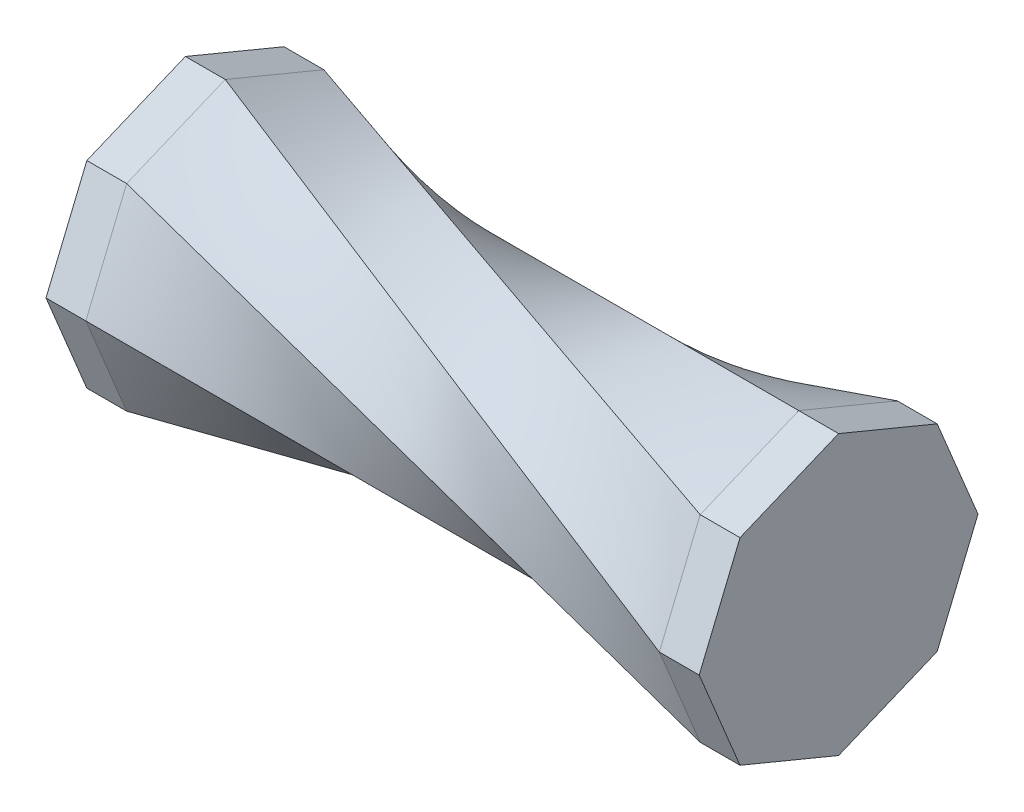
ISO-10303-21;
HEADER;
FILE_DESCRIPTION(('STEP AP214'),'2;1');
FILE_NAME('part.step','',(''),(''),'','','');
FILE_SCHEMA(('AUTOMOTIVE_DESIGN { 1 0 10303 214 1 1 1 1 }'));
ENDSEC;
DATA;
#1=APPLICATION_CONTEXT('core data for automotive mechanical design processes');
#2=APPLICATION_PROTOCOL_DEFINITION('international standard','automotive_design',2000,#1);
#3=PRODUCT_CONTEXT('',#1,'mechanical');
#4=PRODUCT('Part','Part','',(#3));
#5=PRODUCT_RELATED_PRODUCT_CATEGORY('part','',(#4));
#6=PRODUCT_DEFINITION_FORMATION('','',#4);
#7=PRODUCT_DEFINITION_CONTEXT('part definition',#1,'design');
#8=PRODUCT_DEFINITION('design','',#6,#7);
#9=PRODUCT_DEFINITION_SHAPE('','',#8);
#10=(LENGTH_UNIT() NAMED_UNIT(*) SI_UNIT(.MILLI.,.METRE.));
#11=(NAMED_UNIT(*) PLANE_ANGLE_UNIT() SI_UNIT($,.RADIAN.));
#12=(NAMED_UNIT(*) SI_UNIT($,.STERADIAN.) SOLID_ANGLE_UNIT());
#13=UNCERTAINTY_MEASURE_WITH_UNIT(LENGTH_MEASURE(1.E-05),#10,'distance_accuracy_value','');
#14=(GEOMETRIC_REPRESENTATION_CONTEXT(3) GLOBAL_UNCERTAINTY_ASSIGNED_CONTEXT((#13)) GLOBAL_UNIT_ASSIGNED_CONTEXT((#10,
#11,#12)) REPRESENTATION_CONTEXT('',''));
#15=CARTESIAN_POINT('',(0.,0.,0.));
#16=DIRECTION('',(0.,0.,1.));
#17=DIRECTION('',(1.,0.,0.));
#18=AXIS2_PLACEMENT_3D('',#15,#16,#17);
#19=CARTESIAN_POINT('',(0.,-8.75,0.));
#20=CARTESIAN_POINT('',(36.,0.,-8.75));
#21=CARTESIAN_POINT('',(0.,-8.32286405589705,-1.03119738923046));
#22=CARTESIAN_POINT('',(36.,1.03119738923038,-8.32286405589705));
#23=CARTESIAN_POINT('',(0.,-7.8957281117941,-2.06239477846083));
#24=CARTESIAN_POINT('',(36.,2.06239477846076,-7.8957281117941));
#25=CARTESIAN_POINT('',(0.,-7.0414562235882,-4.12478955692156));
#26=CARTESIAN_POINT('',(36.,4.12478955692152,-7.0414562235882));
#27=CARTESIAN_POINT('',(0.,-6.61432027948524,-5.15598694615192));
#28=CARTESIAN_POINT('',(36.,5.1559869461519,-6.61432027948525));
#29=CARTESIAN_POINT('',(0.,-6.18718433538229,-6.18718433538229));
#30=CARTESIAN_POINT('',(36.,6.18718433538228,-6.1871843353823));
#31=B_SPLINE_SURFACE_WITH_KNOTS('',3,1,((#19,#20),(#21,#22),(#23,#24),(#25,#26),(#27,#28),(#29,
#30)),.UNSPECIFIED.,.F.,.F.,.F.,(4,2,4),(2,2),(0.,0.5,1.),(0.,1.),.UNSPECIFIED.);
#32=DIRECTION('',(0.,0.382683432365095,-0.923879532511285));
#33=VECTOR('',#32,1.);
#34=CARTESIAN_POINT('',(0.,-8.75,0.));
#35=LINE('',#34,#33);
#36=CARTESIAN_POINT('',(0.,-8.75,0.));
#37=VERTEX_POINT('',#36);
#38=CARTESIAN_POINT('',(0.,-6.18718433538229,-6.18718433538229));
#39=VERTEX_POINT('',#38);
#40=EDGE_CURVE('E545',#37,#39,#35,.T.);
#41=DIRECTION('',(0.945691697661904,0.325064936548601,0.));
#42=VECTOR('',#41,1.);
#43=CARTESIAN_POINT('',(18.,0.,-6.18718433538229));
#44=LINE('',#43,#42);
#45=CARTESIAN_POINT('',(36.,6.18718433538229,-6.1871843353823));
#46=VERTEX_POINT('',#45);
#47=EDGE_CURVE('E539',#39,#46,#44,.T.);
#48=DIRECTION('',(0.,0.923879532511287,0.382683432365089));
#49=VECTOR('',#48,1.);
#50=CARTESIAN_POINT('',(36.,0.,-8.75));
#51=LINE('',#50,#49);
#52=CARTESIAN_POINT('',(36.,0.,-8.75));
#53=VERTEX_POINT('',#52);
#54=EDGE_CURVE('E12',#53,#46,#51,.T.);
#55=DIRECTION('',(-0.945691697661905,-0.229855620959491,0.229855620959488));
#56=VECTOR('',#55,1.);
#57=CARTESIAN_POINT('',(18.,-4.375,-4.37500000000005));
#58=LINE('',#57,#56);
#59=EDGE_CURVE('E83',#53,#37,#58,.T.);
#60=ORIENTED_EDGE('',*,*,#40,.T.);
#61=ORIENTED_EDGE('',*,*,#47,.T.);
#62=ORIENTED_EDGE('',*,*,#54,.F.);
#63=ORIENTED_EDGE('',*,*,#59,.T.);
#64=EDGE_LOOP('',(#60,#61,#62,#63));
#65=FACE_BOUND('',#64,.T.);
#66=ADVANCED_FACE('F61',(#65),#31,.T.);
#67=CARTESIAN_POINT('',(0.,-6.18718433538229,-6.18718433538229));
#68=CARTESIAN_POINT('',(36.,6.18718433538229,-6.1871843353823));
#69=CARTESIAN_POINT('',(0.,-5.1559869461519,-6.61432027948525));
#70=CARTESIAN_POINT('',(36.,6.61432027948524,-5.15598694615192));
#71=CARTESIAN_POINT('',(0.,-4.12478955692151,-7.0414562235882));
#72=CARTESIAN_POINT('',(36.,7.04145622358819,-4.12478955692153));
#73=CARTESIAN_POINT('',(0.,-2.06239477846075,-7.89572811179411));
#74=CARTESIAN_POINT('',(36.,7.89572811179409,-2.06239477846076));
#75=CARTESIAN_POINT('',(0.,-1.03119738923037,-8.32286405589706));
#76=CARTESIAN_POINT('',(36.,8.32286405589704,-1.03119738923038));
#77=CARTESIAN_POINT('',(0.,0.,-8.75));
#78=CARTESIAN_POINT('',(36.,8.75,0.));
#79=B_SPLINE_SURFACE_WITH_KNOTS('',3,1,((#67,#68),(#69,#70),(#71,#72),(#73,#74),(#75,#76),(#77,
#78)),.UNSPECIFIED.,.F.,.F.,.F.,(4,2,4),(2,2),(0.,0.5,1.),(0.,1.),.UNSPECIFIED.);
#80=DIRECTION('',(0.,0.923879532511287,-0.38268343236509));
#81=VECTOR('',#80,1.);
#82=CARTESIAN_POINT('',(0.,-6.18718433538229,-6.18718433538229));
#83=LINE('',#82,#81);
#84=CARTESIAN_POINT('',(0.,0.,-8.75));
#85=VERTEX_POINT('',#84);
#86=EDGE_CURVE('E369',#39,#85,#83,.T.);
#87=DIRECTION('',(0.945691697661904,0.22985562095949,0.229855620959491));
#88=VECTOR('',#87,1.);
#89=CARTESIAN_POINT('',(18.,4.375,-4.375));
#90=LINE('',#89,#88);
#91=CARTESIAN_POINT('',(36.,8.75,0.));
#92=VERTEX_POINT('',#91);
#93=EDGE_CURVE('E389',#85,#92,#90,.T.);
#94=DIRECTION('',(0.,0.38268343236509,0.923879532511287));
#95=VECTOR('',#94,1.);
#96=CARTESIAN_POINT('',(36.,6.18718433538229,-6.1871843353823));
#97=LINE('',#96,#95);
#98=EDGE_CURVE('E68',#46,#92,#97,.T.);
#99=ORIENTED_EDGE('',*,*,#86,.T.);
#100=ORIENTED_EDGE('',*,*,#93,.T.);
#101=ORIENTED_EDGE('',*,*,#98,.F.);
#102=ORIENTED_EDGE('',*,*,#47,.F.);
#103=EDGE_LOOP('',(#99,#100,#101,#102));
#104=FACE_BOUND('',#103,.T.);
#105=ADVANCED_FACE('F565',(#104),#79,.T.);
#106=CARTESIAN_POINT('',(0.,-6.18718433538229,6.18718433538229));
#107=CARTESIAN_POINT('',(36.,-6.18718433538229,-6.18718433538229));
#108=CARTESIAN_POINT('',(0.,-6.61432027948524,5.15598694615189));
#109=CARTESIAN_POINT('',(36.,-5.15598694615191,-6.61432027948524));
#110=CARTESIAN_POINT('',(0.,-7.04145622358819,4.12478955692149));
#111=CARTESIAN_POINT('',(36.,-4.12478955692153,-7.0414562235882));
#112=CARTESIAN_POINT('',(0.,-7.8957281117941,2.06239477846069));
#113=CARTESIAN_POINT('',(36.,-2.06239477846077,-7.8957281117941));
#114=CARTESIAN_POINT('',(0.,-8.32286405589705,1.0311973892303));
#115=CARTESIAN_POINT('',(36.,-1.03119738923038,-8.32286405589705));
#116=CARTESIAN_POINT('',(0.,-8.75,0.));
#117=CARTESIAN_POINT('',(36.,0.,-8.75));
#118=B_SPLINE_SURFACE_WITH_KNOTS('',3,1,((#106,#107),(#108,#109),(#110,#111),(#112,#113),(#114,
#115),(#116,#117)),.UNSPECIFIED.,.F.,.F.,.F.,(4,2,4),(2,2),(0.,0.5,1.),(0.,1.),.UNSPECIFIED.);
#119=DIRECTION('',(0.,-0.382683432365084,-0.923879532511289));
#120=VECTOR('',#119,1.);
#121=CARTESIAN_POINT('',(0.,-6.18718433538229,6.18718433538229));
#122=LINE('',#121,#120);
#123=CARTESIAN_POINT('',(0.,-6.18718433538229,6.18718433538229));
#124=VERTEX_POINT('',#123);
#125=EDGE_CURVE('E271',#124,#37,#122,.T.);
#126=DIRECTION('',(0.,0.923879532511287,-0.38268343236509));
#127=VECTOR('',#126,1.);
#128=CARTESIAN_POINT('',(36.,-6.18718433538229,-6.18718433538229));
#129=LINE('',#128,#127);
#130=CARTESIAN_POINT('',(36.,-6.18718433538229,-6.18718433538229));
#131=VERTEX_POINT('',#130);
#132=EDGE_CURVE('E75',#131,#53,#129,.T.);
#133=DIRECTION('',(0.945691697661904,0.,-0.325064936548601));
#134=VECTOR('',#133,1.);
#135=CARTESIAN_POINT('',(18.,-6.18718433538229,0.));
#136=LINE('',#135,#134);
#137=EDGE_CURVE('E511',#124,#131,#136,.T.);
#138=ORIENTED_EDGE('',*,*,#125,.T.);
#139=ORIENTED_EDGE('',*,*,#59,.F.);
#140=ORIENTED_EDGE('',*,*,#132,.F.);
#141=ORIENTED_EDGE('',*,*,#137,.F.);
#142=EDGE_LOOP('',(#138,#139,#140,#141));
#143=FACE_BOUND('',#142,.T.);
#144=ADVANCED_FACE('F410',(#143),#118,.T.);
#145=CARTESIAN_POINT('',(0.,0.,-8.75));
#146=CARTESIAN_POINT('',(36.,8.75,0.));
#147=CARTESIAN_POINT('',(0.,1.03119738923038,-8.32286405589705));
#148=CARTESIAN_POINT('',(36.,8.32286405589704,1.03119738923039));
#149=CARTESIAN_POINT('',(0.,2.06239477846076,-7.8957281117941));
#150=CARTESIAN_POINT('',(36.,7.89572811179409,2.06239477846077));
#151=CARTESIAN_POINT('',(0.,4.12478955692152,-7.0414562235882));
#152=CARTESIAN_POINT('',(36.,7.04145622358819,4.12478955692153));
#153=CARTESIAN_POINT('',(0.,5.1559869461519,-6.61432027948525));
#154=CARTESIAN_POINT('',(36.,6.61432027948524,5.15598694615191));
#155=CARTESIAN_POINT('',(0.,6.18718433538228,-6.1871843353823));
#156=CARTESIAN_POINT('',(36.,6.18718433538229,6.18718433538229));
#157=B_SPLINE_SURFACE_WITH_KNOTS('',3,1,((#145,#146),(#147,#148),(#149,#150),(#151,#152),(#153,
#154),(#155,#156)),.UNSPECIFIED.,.F.,.F.,.F.,(4,2,4),(2,2),(0.,0.5,1.),(0.,1.),.UNSPECIFIED.);
#158=DIRECTION('',(0.,0.923879532511287,0.382683432365089));
#159=VECTOR('',#158,1.);
#160=CARTESIAN_POINT('',(0.,0.,-8.75));
#161=LINE('',#160,#159);
#162=CARTESIAN_POINT('',(0.,6.18718433538229,-6.1871843353823));
#163=VERTEX_POINT('',#162);
#164=EDGE_CURVE('E364',#85,#163,#161,.T.);
#165=DIRECTION('',(0.945691697661904,0.,0.325064936548601));
#166=VECTOR('',#165,1.);
#167=CARTESIAN_POINT('',(18.,6.18718433538229,0.));
#168=LINE('',#167,#166);
#169=CARTESIAN_POINT('',(36.,6.18718433538229,6.18718433538229));
#170=VERTEX_POINT('',#169);
#171=EDGE_CURVE('E386',#163,#170,#168,.T.);
#172=DIRECTION('',(0.,-0.38268343236509,0.923879532511287));
#173=VECTOR('',#172,1.);
#174=CARTESIAN_POINT('',(36.,8.75,0.));
#175=LINE('',#174,#173);
#176=EDGE_CURVE('E599',#92,#170,#175,.T.);
#177=ORIENTED_EDGE('',*,*,#164,.T.);
#178=ORIENTED_EDGE('',*,*,#171,.T.);
#179=ORIENTED_EDGE('',*,*,#176,.F.);
#180=ORIENTED_EDGE('',*,*,#93,.F.);
#181=EDGE_LOOP('',(#177,#178,#179,#180));
#182=FACE_BOUND('',#181,.T.);
#183=ADVANCED_FACE('F385',(#182),#157,.T.);
#184=CARTESIAN_POINT('',(0.,6.18718433538229,-6.1871843353823));
#185=CARTESIAN_POINT('',(36.,6.18718433538229,6.18718433538229));
#186=CARTESIAN_POINT('',(0.,6.61432027948524,-5.15598694615192));
#187=CARTESIAN_POINT('',(36.,5.15598694615192,6.61432027948524));
#188=CARTESIAN_POINT('',(0.,7.04145622358819,-4.12478955692154));
#189=CARTESIAN_POINT('',(36.,4.12478955692154,7.04145622358819));
#190=CARTESIAN_POINT('',(0.,7.89572811179409,-2.06239477846077));
#191=CARTESIAN_POINT('',(36.,2.06239477846078,7.89572811179409));
#192=CARTESIAN_POINT('',(0.,8.32286405589704,-1.03119738923038));
#193=CARTESIAN_POINT('',(36.,1.03119738923039,8.32286405589704));
#194=CARTESIAN_POINT('',(0.,8.75,0.));
#195=CARTESIAN_POINT('',(36.,0.,8.75));
#196=B_SPLINE_SURFACE_WITH_KNOTS('',3,1,((#184,#185),(#186,#187),(#188,#189),(#190,#191),(#192,
#193),(#194,#195)),.UNSPECIFIED.,.F.,.F.,.F.,(4,2,4),(2,2),(0.,0.5,1.),(0.,1.),.UNSPECIFIED.);
#197=DIRECTION('',(0.,0.38268343236509,0.923879532511287));
#198=VECTOR('',#197,1.);
#199=CARTESIAN_POINT('',(0.,6.18718433538229,-6.1871843353823));
#200=LINE('',#199,#198);
#201=CARTESIAN_POINT('',(0.,8.75,0.));
#202=VERTEX_POINT('',#201);
#203=EDGE_CURVE('E288',#163,#202,#200,.T.);
#204=DIRECTION('',(0.945691697661904,-0.229855620959491,0.22985562095949));
#205=VECTOR('',#204,1.);
#206=CARTESIAN_POINT('',(18.,4.375,4.375));
#207=LINE('',#206,#205);
#208=CARTESIAN_POINT('',(36.,0.,8.75));
#209=VERTEX_POINT('',#208);
#210=EDGE_CURVE('E493',#202,#209,#207,.T.);
#211=DIRECTION('',(0.,-0.923879532511287,0.38268343236509));
#212=VECTOR('',#211,1.);
#213=CARTESIAN_POINT('',(36.,6.18718433538229,6.18718433538229));
#214=LINE('',#213,#212);
#215=EDGE_CURVE('E439',#170,#209,#214,.T.);
#216=ORIENTED_EDGE('',*,*,#203,.T.);
#217=ORIENTED_EDGE('',*,*,#210,.T.);
#218=ORIENTED_EDGE('',*,*,#215,.F.);
#219=ORIENTED_EDGE('',*,*,#171,.F.);
#220=EDGE_LOOP('',(#216,#217,#218,#219));
#221=FACE_BOUND('',#220,.T.);
#222=ADVANCED_FACE('F409',(#221),#196,.T.);
#223=CARTESIAN_POINT('',(0.,8.75,0.));
#224=CARTESIAN_POINT('',(36.,0.,8.75));
#225=CARTESIAN_POINT('',(0.,8.32286405589705,1.03119738923038));
#226=CARTESIAN_POINT('',(36.,-1.03119738923038,8.32286405589705));
#227=CARTESIAN_POINT('',(0.,7.89572811179409,2.06239477846076));
#228=CARTESIAN_POINT('',(36.,-2.06239477846076,7.8957281117941));
#229=CARTESIAN_POINT('',(0.,7.04145622358819,4.12478955692153));
#230=CARTESIAN_POINT('',(36.,-4.12478955692152,7.04145622358819));
#231=CARTESIAN_POINT('',(0.,6.61432027948524,5.15598694615191));
#232=CARTESIAN_POINT('',(36.,-5.15598694615191,6.61432027948524));
#233=CARTESIAN_POINT('',(0.,6.18718433538229,6.18718433538229));
#234=CARTESIAN_POINT('',(36.,-6.18718433538229,6.18718433538229));
#235=B_SPLINE_SURFACE_WITH_KNOTS('',3,1,((#223,#224),(#225,#226),(#227,#228),(#229,#230),(#231,
#232),(#233,#234)),.UNSPECIFIED.,.F.,.F.,.F.,(4,2,4),(2,2),(0.,0.5,1.),(0.,1.),.UNSPECIFIED.);
#236=DIRECTION('',(0.,-0.38268343236509,0.923879532511287));
#237=VECTOR('',#236,1.);
#238=CARTESIAN_POINT('',(0.,8.75,0.));
#239=LINE('',#238,#237);
#240=CARTESIAN_POINT('',(0.,6.18718433538229,6.18718433538229));
#241=VERTEX_POINT('',#240);
#242=EDGE_CURVE('E284',#202,#241,#239,.T.);
#243=DIRECTION('',(0.945691697661904,-0.325064936548601,0.));
#244=VECTOR('',#243,1.);
#245=CARTESIAN_POINT('',(18.,0.,6.18718433538229));
#246=LINE('',#245,#244);
#247=CARTESIAN_POINT('',(36.,-6.18718433538229,6.18718433538229));
#248=VERTEX_POINT('',#247);
#249=EDGE_CURVE('E484',#241,#248,#246,.T.);
#250=DIRECTION('',(0.,-0.923879532511287,-0.38268343236509));
#251=VECTOR('',#250,1.);
#252=CARTESIAN_POINT('',(36.,0.,8.75));
#253=LINE('',#252,#251);
#254=EDGE_CURVE('E453',#209,#248,#253,.T.);
#255=ORIENTED_EDGE('',*,*,#242,.T.);
#256=ORIENTED_EDGE('',*,*,#249,.T.);
#257=ORIENTED_EDGE('',*,*,#254,.F.);
#258=ORIENTED_EDGE('',*,*,#210,.F.);
#259=EDGE_LOOP('',(#255,#256,#257,#258));
#260=FACE_BOUND('',#259,.T.);
#261=ADVANCED_FACE('F458',(#260),#235,.T.);
#262=CARTESIAN_POINT('',(0.,6.18718433538229,6.18718433538229));
#263=CARTESIAN_POINT('',(36.,-6.18718433538229,6.18718433538229));
#264=CARTESIAN_POINT('',(0.,5.15598694615191,6.61432027948524));
#265=CARTESIAN_POINT('',(36.,-6.61432027948525,5.15598694615188));
#266=CARTESIAN_POINT('',(0.,4.12478955692153,7.04145622358819));
#267=CARTESIAN_POINT('',(36.,-7.0414562235882,4.12478955692147));
#268=CARTESIAN_POINT('',(0.,2.06239477846076,7.8957281117941));
#269=CARTESIAN_POINT('',(36.,-7.89572811179411,2.06239477846067));
#270=CARTESIAN_POINT('',(0.,1.03119738923038,8.32286405589705));
#271=CARTESIAN_POINT('',(36.,-8.32286405589705,1.03119738923028));
#272=CARTESIAN_POINT('',(0.,0.,8.75));
#273=CARTESIAN_POINT('',(36.,-8.75,0.));
#274=B_SPLINE_SURFACE_WITH_KNOTS('',3,1,((#262,#263),(#264,#265),(#266,#267),(#268,#269),(#270,
#271),(#272,#273)),.UNSPECIFIED.,.F.,.F.,.F.,(4,2,4),(2,2),(0.,0.5,1.),(0.,1.),.UNSPECIFIED.);
#275=DIRECTION('',(0.,-0.923879532511287,0.38268343236509));
#276=VECTOR('',#275,1.);
#277=CARTESIAN_POINT('',(0.,6.18718433538229,6.18718433538229));
#278=LINE('',#277,#276);
#279=CARTESIAN_POINT('',(0.,0.,8.75));
#280=VERTEX_POINT('',#279);
#281=EDGE_CURVE('E219',#241,#280,#278,.T.);
#282=DIRECTION('',(0.945691697661904,-0.22985562095949,-0.229855620959493));
#283=VECTOR('',#282,1.);
#284=CARTESIAN_POINT('',(18.,-4.375,4.37499999999995));
#285=LINE('',#284,#283);
#286=CARTESIAN_POINT('',(36.,-8.75,0.));
#287=VERTEX_POINT('',#286);
#288=EDGE_CURVE('E492',#280,#287,#285,.T.);
#289=DIRECTION('',(0.,-0.382683432365084,-0.923879532511289));
#290=VECTOR('',#289,1.);
#291=CARTESIAN_POINT('',(36.,-6.18718433538229,6.18718433538229));
#292=LINE('',#291,#290);
#293=EDGE_CURVE('E689',#248,#287,#292,.T.);
#294=ORIENTED_EDGE('',*,*,#281,.T.);
#295=ORIENTED_EDGE('',*,*,#288,.T.);
#296=ORIENTED_EDGE('',*,*,#293,.F.);
#297=ORIENTED_EDGE('',*,*,#249,.F.);
#298=EDGE_LOOP('',(#294,#295,#296,#297));
#299=FACE_BOUND('',#298,.T.);
#300=ADVANCED_FACE('F468',(#299),#274,.T.);
#301=CARTESIAN_POINT('',(0.,0.,8.75));
#302=CARTESIAN_POINT('',(36.,-8.75,0.));
#303=CARTESIAN_POINT('',(0.,-1.03119738923038,8.32286405589705));
#304=CARTESIAN_POINT('',(36.,-8.32286405589705,-1.03119738923046));
#305=CARTESIAN_POINT('',(0.,-2.06239477846077,7.8957281117941));
#306=CARTESIAN_POINT('',(36.,-7.8957281117941,-2.06239477846083));
#307=CARTESIAN_POINT('',(0.,-4.12478955692153,7.04145622358819));
#308=CARTESIAN_POINT('',(36.,-7.0414562235882,-4.12478955692156));
#309=CARTESIAN_POINT('',(0.,-5.15598694615191,6.61432027948524));
#310=CARTESIAN_POINT('',(36.,-6.61432027948524,-5.15598694615192));
#311=CARTESIAN_POINT('',(0.,-6.18718433538229,6.18718433538229));
#312=CARTESIAN_POINT('',(36.,-6.18718433538229,-6.18718433538229));
#313=B_SPLINE_SURFACE_WITH_KNOTS('',3,1,((#301,#302),(#303,#304),(#305,#306),(#307,#308),(#309,
#310),(#311,#312)),.UNSPECIFIED.,.F.,.F.,.F.,(4,2,4),(2,2),(0.,0.5,1.),(0.,1.),.UNSPECIFIED.);
#314=DIRECTION('',(0.,-0.923879532511287,-0.38268343236509));
#315=VECTOR('',#314,1.);
#316=CARTESIAN_POINT('',(0.,0.,8.75));
#317=LINE('',#316,#315);
#318=EDGE_CURVE('E266',#280,#124,#317,.T.);
#319=DIRECTION('',(0.,0.382683432365095,-0.923879532511285));
#320=VECTOR('',#319,1.);
#321=CARTESIAN_POINT('',(36.,-8.75,0.));
#322=LINE('',#321,#320);
#323=EDGE_CURVE('E698',#287,#131,#322,.T.);
#324=ORIENTED_EDGE('',*,*,#318,.T.);
#325=ORIENTED_EDGE('',*,*,#137,.T.);
#326=ORIENTED_EDGE('',*,*,#323,.F.);
#327=ORIENTED_EDGE('',*,*,#288,.F.);
#328=EDGE_LOOP('',(#324,#325,#326,#327));
#329=FACE_BOUND('',#328,.T.);
#330=ADVANCED_FACE('F63',(#329),#313,.T.);
#331=CARTESIAN_POINT('',(-2.5,6.18718433538229,6.18718433538229));
#332=DIRECTION('',(0.,-0.923879532511287,-0.38268343236509));
#333=DIRECTION('',(0.,0.38268343236509,-0.923879532511287));
#334=AXIS2_PLACEMENT_3D('',#331,#332,#333);
#335=PLANE('',#334);
#336=ORIENTED_EDGE('',*,*,#242,.F.);
#337=DIRECTION('',(1.,0.,0.));
#338=VECTOR('',#337,1.);
#339=CARTESIAN_POINT('',(-2.5,8.75,0.));
#340=LINE('',#339,#338);
#341=CARTESIAN_POINT('',(-2.5,8.75,0.));
#342=VERTEX_POINT('',#341);
#343=EDGE_CURVE('E330',#342,#202,#340,.T.);
#344=ORIENTED_EDGE('',*,*,#343,.F.);
#345=DIRECTION('',(0.,0.38268343236509,-0.923879532511287));
#346=VECTOR('',#345,1.);
#347=CARTESIAN_POINT('',(-2.5,6.18718433538229,6.18718433538229));
#348=LINE('',#347,#346);
#349=CARTESIAN_POINT('',(-2.5,6.18718433538229,6.18718433538229));
#350=VERTEX_POINT('',#349);
#351=EDGE_CURVE('E208',#350,#342,#348,.T.);
#352=ORIENTED_EDGE('',*,*,#351,.F.);
#353=DIRECTION('',(1.,0.,0.));
#354=VECTOR('',#353,1.);
#355=CARTESIAN_POINT('',(-2.5,6.18718433538229,6.18718433538229));
#356=LINE('',#355,#354);
#357=EDGE_CURVE('E618',#350,#241,#356,.T.);
#358=ORIENTED_EDGE('',*,*,#357,.T.);
#359=EDGE_LOOP('',(#336,#344,#352,#358));
#360=FACE_BOUND('',#359,.T.);
#361=ADVANCED_FACE('F313',(#360),#335,.F.);
#362=CARTESIAN_POINT('',(-2.5,8.75,0.));
#363=DIRECTION('',(0.,-0.923879532511287,0.38268343236509));
#364=DIRECTION('',(0.,-0.38268343236509,-0.923879532511287));
#365=AXIS2_PLACEMENT_3D('',#362,#363,#364);
#366=PLANE('',#365);
#367=ORIENTED_EDGE('',*,*,#203,.F.);
#368=DIRECTION('',(1.,0.,0.));
#369=VECTOR('',#368,1.);
#370=CARTESIAN_POINT('',(-2.5,6.18718433538229,-6.1871843353823));
#371=LINE('',#370,#369);
#372=CARTESIAN_POINT('',(-2.5,6.18718433538229,-6.1871843353823));
#373=VERTEX_POINT('',#372);
#374=EDGE_CURVE('E300',#373,#163,#371,.T.);
#375=ORIENTED_EDGE('',*,*,#374,.F.);
#376=DIRECTION('',(0.,-0.38268343236509,-0.923879532511287));
#377=VECTOR('',#376,1.);
#378=CARTESIAN_POINT('',(-2.5,8.75,0.));
#379=LINE('',#378,#377);
#380=EDGE_CURVE('E213',#342,#373,#379,.T.);
#381=ORIENTED_EDGE('',*,*,#380,.F.);
#382=ORIENTED_EDGE('',*,*,#343,.T.);
#383=EDGE_LOOP('',(#367,#375,#381,#382));
#384=FACE_BOUND('',#383,.T.);
#385=ADVANCED_FACE('F302',(#384),#366,.F.);
#386=CARTESIAN_POINT('',(-2.5,6.18718433538229,-6.1871843353823));
#387=DIRECTION('',(0.,-0.382683432365089,0.923879532511287));
#388=DIRECTION('',(0.,-0.923879532511287,-0.382683432365089));
#389=AXIS2_PLACEMENT_3D('',#386,#387,#388);
#390=PLANE('',#389);
#391=ORIENTED_EDGE('',*,*,#164,.F.);
#392=DIRECTION('',(1.,0.,0.));
#393=VECTOR('',#392,1.);
#394=CARTESIAN_POINT('',(-2.5,0.,-8.75));
#395=LINE('',#394,#393);
#396=CARTESIAN_POINT('',(-2.5,0.,-8.75));
#397=VERTEX_POINT('',#396);
#398=EDGE_CURVE('E341',#397,#85,#395,.T.);
#399=ORIENTED_EDGE('',*,*,#398,.F.);
#400=DIRECTION('',(0.,-0.923879532511287,-0.382683432365089));
#401=VECTOR('',#400,1.);
#402=CARTESIAN_POINT('',(-2.5,6.18718433538229,-6.1871843353823));
#403=LINE('',#402,#401);
#404=EDGE_CURVE('E641',#373,#397,#403,.T.);
#405=ORIENTED_EDGE('',*,*,#404,.F.);
#406=ORIENTED_EDGE('',*,*,#374,.T.);
#407=EDGE_LOOP('',(#391,#399,#405,#406));
#408=FACE_BOUND('',#407,.T.);
#409=ADVANCED_FACE('F312',(#408),#390,.F.);
#410=CARTESIAN_POINT('',(-2.5,0.,-8.75));
#411=DIRECTION('',(0.,0.38268343236509,0.923879532511287));
#412=DIRECTION('',(0.,-0.923879532511287,0.38268343236509));
#413=AXIS2_PLACEMENT_3D('',#410,#411,#412);
#414=PLANE('',#413);
#415=ORIENTED_EDGE('',*,*,#86,.F.);
#416=DIRECTION('',(1.,0.,0.));
#417=VECTOR('',#416,1.);
#418=CARTESIAN_POINT('',(-2.5,-6.18718433538229,-6.18718433538229));
#419=LINE('',#418,#417);
#420=CARTESIAN_POINT('',(-2.5,-6.18718433538229,-6.18718433538229));
#421=VERTEX_POINT('',#420);
#422=EDGE_CURVE('E347',#421,#39,#419,.T.);
#423=ORIENTED_EDGE('',*,*,#422,.F.);
#424=DIRECTION('',(0.,-0.923879532511287,0.38268343236509));
#425=VECTOR('',#424,1.);
#426=CARTESIAN_POINT('',(-2.5,0.,-8.75));
#427=LINE('',#426,#425);
#428=EDGE_CURVE('E638',#397,#421,#427,.T.);
#429=ORIENTED_EDGE('',*,*,#428,.F.);
#430=ORIENTED_EDGE('',*,*,#398,.T.);
#431=EDGE_LOOP('',(#415,#423,#429,#430));
#432=FACE_BOUND('',#431,.T.);
#433=ADVANCED_FACE('F918',(#432),#414,.F.);
#434=CARTESIAN_POINT('',(-2.5,-6.18718433538229,-6.18718433538229));
#435=DIRECTION('',(0.,0.923879532511285,0.382683432365095));
#436=DIRECTION('',(0.,-0.382683432365095,0.923879532511285));
#437=AXIS2_PLACEMENT_3D('',#434,#435,#436);
#438=PLANE('',#437);
#439=ORIENTED_EDGE('',*,*,#40,.F.);
#440=DIRECTION('',(1.,0.,0.));
#441=VECTOR('',#440,1.);
#442=CARTESIAN_POINT('',(-2.5,-8.75,0.));
#443=LINE('',#442,#441);
#444=CARTESIAN_POINT('',(-2.5,-8.75,0.));
#445=VERTEX_POINT('',#444);
#446=EDGE_CURVE('E355',#445,#37,#443,.T.);
#447=ORIENTED_EDGE('',*,*,#446,.F.);
#448=DIRECTION('',(0.,-0.382683432365095,0.923879532511285));
#449=VECTOR('',#448,1.);
#450=CARTESIAN_POINT('',(-2.5,-6.18718433538229,-6.18718433538229));
#451=LINE('',#450,#449);
#452=EDGE_CURVE('E633',#421,#445,#451,.T.);
#453=ORIENTED_EDGE('',*,*,#452,.F.);
#454=ORIENTED_EDGE('',*,*,#422,.T.);
#455=EDGE_LOOP('',(#439,#447,#453,#454));
#456=FACE_BOUND('',#455,.T.);
#457=ADVANCED_FACE('F910',(#456),#438,.F.);
#458=CARTESIAN_POINT('',(-2.5,-8.75,0.));
#459=DIRECTION('',(0.,0.923879532511289,-0.382683432365084));
#460=DIRECTION('',(0.,0.382683432365084,0.923879532511289));
#461=AXIS2_PLACEMENT_3D('',#458,#459,#460);
#462=PLANE('',#461);
#463=ORIENTED_EDGE('',*,*,#125,.F.);
#464=DIRECTION('',(1.,0.,0.));
#465=VECTOR('',#464,1.);
#466=CARTESIAN_POINT('',(-2.5,-6.18718433538229,6.18718433538229));
#467=LINE('',#466,#465);
#468=CARTESIAN_POINT('',(-2.5,-6.18718433538229,6.18718433538229));
#469=VERTEX_POINT('',#468);
#470=EDGE_CURVE('E625',#469,#124,#467,.T.);
#471=ORIENTED_EDGE('',*,*,#470,.F.);
#472=DIRECTION('',(0.,0.382683432365084,0.923879532511289));
#473=VECTOR('',#472,1.);
#474=CARTESIAN_POINT('',(-2.5,-8.75,0.));
#475=LINE('',#474,#473);
#476=EDGE_CURVE('E629',#445,#469,#475,.T.);
#477=ORIENTED_EDGE('',*,*,#476,.F.);
#478=ORIENTED_EDGE('',*,*,#446,.T.);
#479=EDGE_LOOP('',(#463,#471,#477,#478));
#480=FACE_BOUND('',#479,.T.);
#481=ADVANCED_FACE('F902',(#480),#462,.F.);
#482=CARTESIAN_POINT('',(-2.5,-6.18718433538229,6.18718433538229));
#483=DIRECTION('',(0.,0.38268343236509,-0.923879532511287));
#484=DIRECTION('',(0.,0.923879532511287,0.38268343236509));
#485=AXIS2_PLACEMENT_3D('',#482,#483,#484);
#486=PLANE('',#485);
#487=ORIENTED_EDGE('',*,*,#318,.F.);
#488=DIRECTION('',(1.,0.,0.));
#489=VECTOR('',#488,1.);
#490=CARTESIAN_POINT('',(-2.5,0.,8.75));
#491=LINE('',#490,#489);
#492=CARTESIAN_POINT('',(-2.5,0.,8.75));
#493=VERTEX_POINT('',#492);
#494=EDGE_CURVE('E620',#493,#280,#491,.T.);
#495=ORIENTED_EDGE('',*,*,#494,.F.);
#496=DIRECTION('',(0.,0.923879532511287,0.38268343236509));
#497=VECTOR('',#496,1.);
#498=CARTESIAN_POINT('',(-2.5,-6.18718433538229,6.18718433538229));
#499=LINE('',#498,#497);
#500=EDGE_CURVE('E626',#469,#493,#499,.T.);
#501=ORIENTED_EDGE('',*,*,#500,.F.);
#502=ORIENTED_EDGE('',*,*,#470,.T.);
#503=EDGE_LOOP('',(#487,#495,#501,#502));
#504=FACE_BOUND('',#503,.T.);
#505=ADVANCED_FACE('F248',(#504),#486,.F.);
#506=CARTESIAN_POINT('',(-2.5,0.,8.75));
#507=DIRECTION('',(0.,-0.38268343236509,-0.923879532511287));
#508=DIRECTION('',(0.,0.923879532511287,-0.38268343236509));
#509=AXIS2_PLACEMENT_3D('',#506,#507,#508);
#510=PLANE('',#509);
#511=ORIENTED_EDGE('',*,*,#281,.F.);
#512=ORIENTED_EDGE('',*,*,#357,.F.);
#513=DIRECTION('',(0.,0.923879532511287,-0.38268343236509));
#514=VECTOR('',#513,1.);
#515=CARTESIAN_POINT('',(-2.5,0.,8.75));
#516=LINE('',#515,#514);
#517=EDGE_CURVE('E392',#493,#350,#516,.T.);
#518=ORIENTED_EDGE('',*,*,#517,.F.);
#519=ORIENTED_EDGE('',*,*,#494,.T.);
#520=EDGE_LOOP('',(#511,#512,#518,#519));
#521=FACE_BOUND('',#520,.T.);
#522=ADVANCED_FACE('F243',(#521),#510,.F.);
#523=CARTESIAN_POINT('',(-2.5,0.,0.));
#524=DIRECTION('',(-1.,0.,0.));
#525=DIRECTION('',(0.,0.,1.));
#526=AXIS2_PLACEMENT_3D('',#523,#524,#525);
#527=PLANE('',#526);
#528=ORIENTED_EDGE('',*,*,#351,.T.);
#529=ORIENTED_EDGE('',*,*,#380,.T.);
#530=ORIENTED_EDGE('',*,*,#404,.T.);
#531=ORIENTED_EDGE('',*,*,#428,.T.);
#532=ORIENTED_EDGE('',*,*,#452,.T.);
#533=ORIENTED_EDGE('',*,*,#476,.T.);
#534=ORIENTED_EDGE('',*,*,#500,.T.);
#535=ORIENTED_EDGE('',*,*,#517,.T.);
#536=EDGE_LOOP('',(#528,#529,#530,#531,#532,#533,#534,#535));
#537=FACE_BOUND('',#536,.T.);
#538=ADVANCED_FACE('F238',(#537),#527,.T.);
#539=CARTESIAN_POINT('',(38.5,0.,-8.75));
#540=DIRECTION('',(0.,-0.382683432365089,0.923879532511287));
#541=DIRECTION('',(0.,-0.923879532511287,-0.382683432365089));
#542=AXIS2_PLACEMENT_3D('',#539,#540,#541);
#543=PLANE('',#542);
#544=ORIENTED_EDGE('',*,*,#54,.T.);
#545=DIRECTION('',(-1.,0.,0.));
#546=VECTOR('',#545,1.);
#547=CARTESIAN_POINT('',(38.5,6.18718433538229,-6.1871843353823));
#548=LINE('',#547,#546);
#549=CARTESIAN_POINT('',(38.5,6.18718433538229,-6.1871843353823));
#550=VERTEX_POINT('',#549);
#551=EDGE_CURVE('E187',#550,#46,#548,.T.);
#552=ORIENTED_EDGE('',*,*,#551,.F.);
#553=DIRECTION('',(0.,0.923879532511287,0.382683432365089));
#554=VECTOR('',#553,1.);
#555=CARTESIAN_POINT('',(38.5,0.,-8.75));
#556=LINE('',#555,#554);
#557=CARTESIAN_POINT('',(38.5,0.,-8.75));
#558=VERTEX_POINT('',#557);
#559=EDGE_CURVE('E194',#558,#550,#556,.T.);
#560=ORIENTED_EDGE('',*,*,#559,.F.);
#561=DIRECTION('',(-1.,0.,0.));
#562=VECTOR('',#561,1.);
#563=CARTESIAN_POINT('',(38.5,0.,-8.75));
#564=LINE('',#563,#562);
#565=EDGE_CURVE('E648',#558,#53,#564,.T.);
#566=ORIENTED_EDGE('',*,*,#565,.T.);
#567=EDGE_LOOP('',(#544,#552,#560,#566));
#568=FACE_BOUND('',#567,.T.);
#569=ADVANCED_FACE('F205',(#568),#543,.F.);
#570=CARTESIAN_POINT('',(38.5,6.18718433538229,-6.1871843353823));
#571=DIRECTION('',(0.,-0.923879532511287,0.38268343236509));
#572=DIRECTION('',(0.,-0.38268343236509,-0.923879532511287));
#573=AXIS2_PLACEMENT_3D('',#570,#571,#572);
#574=PLANE('',#573);
#575=ORIENTED_EDGE('',*,*,#98,.T.);
#576=DIRECTION('',(-1.,0.,0.));
#577=VECTOR('',#576,1.);
#578=CARTESIAN_POINT('',(38.5,8.75,0.));
#579=LINE('',#578,#577);
#580=CARTESIAN_POINT('',(38.5,8.75,0.));
#581=VERTEX_POINT('',#580);
#582=EDGE_CURVE('E189',#581,#92,#579,.T.);
#583=ORIENTED_EDGE('',*,*,#582,.F.);
#584=DIRECTION('',(0.,0.38268343236509,0.923879532511287));
#585=VECTOR('',#584,1.);
#586=CARTESIAN_POINT('',(38.5,6.18718433538229,-6.1871843353823));
#587=LINE('',#586,#585);
#588=EDGE_CURVE('E182',#550,#581,#587,.T.);
#589=ORIENTED_EDGE('',*,*,#588,.F.);
#590=ORIENTED_EDGE('',*,*,#551,.T.);
#591=EDGE_LOOP('',(#575,#583,#589,#590));
#592=FACE_BOUND('',#591,.T.);
#593=ADVANCED_FACE('F185',(#592),#574,.F.);
#594=CARTESIAN_POINT('',(38.5,8.75,0.));
#595=DIRECTION('',(0.,-0.923879532511287,-0.38268343236509));
#596=DIRECTION('',(0.,0.38268343236509,-0.923879532511287));
#597=AXIS2_PLACEMENT_3D('',#594,#595,#596);
#598=PLANE('',#597);
#599=ORIENTED_EDGE('',*,*,#176,.T.);
#600=DIRECTION('',(-1.,0.,0.));
#601=VECTOR('',#600,1.);
#602=CARTESIAN_POINT('',(38.5,6.18718433538229,6.18718433538229));
#603=LINE('',#602,#601);
#604=CARTESIAN_POINT('',(38.5,6.18718433538229,6.18718433538229));
#605=VERTEX_POINT('',#604);
#606=EDGE_CURVE('E215',#605,#170,#603,.T.);
#607=ORIENTED_EDGE('',*,*,#606,.F.);
#608=DIRECTION('',(0.,-0.38268343236509,0.923879532511287));
#609=VECTOR('',#608,1.);
#610=CARTESIAN_POINT('',(38.5,8.75,0.));
#611=LINE('',#610,#609);
#612=EDGE_CURVE('E193',#581,#605,#611,.T.);
#613=ORIENTED_EDGE('',*,*,#612,.F.);
#614=ORIENTED_EDGE('',*,*,#582,.T.);
#615=EDGE_LOOP('',(#599,#607,#613,#614));
#616=FACE_BOUND('',#615,.T.);
#617=ADVANCED_FACE('F664',(#616),#598,.F.);
#618=CARTESIAN_POINT('',(38.5,6.18718433538229,6.18718433538229));
#619=DIRECTION('',(0.,-0.38268343236509,-0.923879532511287));
#620=DIRECTION('',(0.,0.923879532511287,-0.38268343236509));
#621=AXIS2_PLACEMENT_3D('',#618,#619,#620);
#622=PLANE('',#621);
#623=ORIENTED_EDGE('',*,*,#215,.T.);
#624=DIRECTION('',(-1.,0.,0.));
#625=VECTOR('',#624,1.);
#626=CARTESIAN_POINT('',(38.5,0.,8.75));
#627=LINE('',#626,#625);
#628=CARTESIAN_POINT('',(38.5,0.,8.75));
#629=VERTEX_POINT('',#628);
#630=EDGE_CURVE('E667',#629,#209,#627,.T.);
#631=ORIENTED_EDGE('',*,*,#630,.F.);
#632=DIRECTION('',(0.,-0.923879532511287,0.38268343236509));
#633=VECTOR('',#632,1.);
#634=CARTESIAN_POINT('',(38.5,6.18718433538229,6.18718433538229));
#635=LINE('',#634,#633);
#636=EDGE_CURVE('E658',#605,#629,#635,.T.);
#637=ORIENTED_EDGE('',*,*,#636,.F.);
#638=ORIENTED_EDGE('',*,*,#606,.T.);
#639=EDGE_LOOP('',(#623,#631,#637,#638));
#640=FACE_BOUND('',#639,.T.);
#641=ADVANCED_FACE('F669',(#640),#622,.F.);
#642=CARTESIAN_POINT('',(38.5,0.,8.75));
#643=DIRECTION('',(0.,0.38268343236509,-0.923879532511287));
#644=DIRECTION('',(0.,0.923879532511287,0.38268343236509));
#645=AXIS2_PLACEMENT_3D('',#642,#643,#644);
#646=PLANE('',#645);
#647=ORIENTED_EDGE('',*,*,#254,.T.);
#648=DIRECTION('',(-1.,0.,0.));
#649=VECTOR('',#648,1.);
#650=CARTESIAN_POINT('',(38.5,-6.18718433538229,6.18718433538229));
#651=LINE('',#650,#649);
#652=CARTESIAN_POINT('',(38.5,-6.18718433538229,6.18718433538229));
#653=VERTEX_POINT('',#652);
#654=EDGE_CURVE('E675',#653,#248,#651,.T.);
#655=ORIENTED_EDGE('',*,*,#654,.F.);
#656=DIRECTION('',(0.,-0.923879532511287,-0.38268343236509));
#657=VECTOR('',#656,1.);
#658=CARTESIAN_POINT('',(38.5,0.,8.75));
#659=LINE('',#658,#657);
#660=EDGE_CURVE('E655',#629,#653,#659,.T.);
#661=ORIENTED_EDGE('',*,*,#660,.F.);
#662=ORIENTED_EDGE('',*,*,#630,.T.);
#663=EDGE_LOOP('',(#647,#655,#661,#662));
#664=FACE_BOUND('',#663,.T.);
#665=ADVANCED_FACE('F678',(#664),#646,.F.);
#666=CARTESIAN_POINT('',(38.5,-6.18718433538229,6.18718433538229));
#667=DIRECTION('',(0.,0.923879532511289,-0.382683432365084));
#668=DIRECTION('',(0.,0.382683432365084,0.923879532511289));
#669=AXIS2_PLACEMENT_3D('',#666,#667,#668);
#670=PLANE('',#669);
#671=ORIENTED_EDGE('',*,*,#293,.T.);
#672=DIRECTION('',(-1.,0.,0.));
#673=VECTOR('',#672,1.);
#674=CARTESIAN_POINT('',(38.5,-8.75,0.));
#675=LINE('',#674,#673);
#676=CARTESIAN_POINT('',(38.5,-8.75,0.));
#677=VERTEX_POINT('',#676);
#678=EDGE_CURVE('E687',#677,#287,#675,.T.);
#679=ORIENTED_EDGE('',*,*,#678,.F.);
#680=DIRECTION('',(0.,-0.382683432365084,-0.923879532511289));
#681=VECTOR('',#680,1.);
#682=CARTESIAN_POINT('',(38.5,-6.18718433538229,6.18718433538229));
#683=LINE('',#682,#681);
#684=EDGE_CURVE('E652',#653,#677,#683,.T.);
#685=ORIENTED_EDGE('',*,*,#684,.F.);
#686=ORIENTED_EDGE('',*,*,#654,.T.);
#687=EDGE_LOOP('',(#671,#679,#685,#686));
#688=FACE_BOUND('',#687,.T.);
#689=ADVANCED_FACE('F688',(#688),#670,.F.);
#690=CARTESIAN_POINT('',(38.5,-8.75,0.));
#691=DIRECTION('',(0.,0.923879532511285,0.382683432365095));
#692=DIRECTION('',(0.,-0.382683432365095,0.923879532511285));
#693=AXIS2_PLACEMENT_3D('',#690,#691,#692);
#694=PLANE('',#693);
#695=ORIENTED_EDGE('',*,*,#323,.T.);
#696=DIRECTION('',(-1.,0.,0.));
#697=VECTOR('',#696,1.);
#698=CARTESIAN_POINT('',(38.5,-6.18718433538229,-6.18718433538229));
#699=LINE('',#698,#697);
#700=CARTESIAN_POINT('',(38.5,-6.18718433538229,-6.18718433538229));
#701=VERTEX_POINT('',#700);
#702=EDGE_CURVE('E694',#701,#131,#699,.T.);
#703=ORIENTED_EDGE('',*,*,#702,.F.);
#704=DIRECTION('',(0.,0.382683432365095,-0.923879532511285));
#705=VECTOR('',#704,1.);
#706=CARTESIAN_POINT('',(38.5,-8.75,0.));
#707=LINE('',#706,#705);
#708=EDGE_CURVE('E649',#677,#701,#707,.T.);
#709=ORIENTED_EDGE('',*,*,#708,.F.);
#710=ORIENTED_EDGE('',*,*,#678,.T.);
#711=EDGE_LOOP('',(#695,#703,#709,#710));
#712=FACE_BOUND('',#711,.T.);
#713=ADVANCED_FACE('F696',(#712),#694,.F.);
#714=CARTESIAN_POINT('',(38.5,-6.18718433538229,-6.18718433538229));
#715=DIRECTION('',(0.,0.38268343236509,0.923879532511287));
#716=DIRECTION('',(0.,-0.923879532511287,0.38268343236509));
#717=AXIS2_PLACEMENT_3D('',#714,#715,#716);
#718=PLANE('',#717);
#719=ORIENTED_EDGE('',*,*,#132,.T.);
#720=ORIENTED_EDGE('',*,*,#565,.F.);
#721=DIRECTION('',(0.,0.923879532511287,-0.38268343236509));
#722=VECTOR('',#721,1.);
#723=CARTESIAN_POINT('',(38.5,-6.18718433538229,-6.18718433538229));
#724=LINE('',#723,#722);
#725=EDGE_CURVE('E199',#701,#558,#724,.T.);
#726=ORIENTED_EDGE('',*,*,#725,.F.);
#727=ORIENTED_EDGE('',*,*,#702,.T.);
#728=EDGE_LOOP('',(#719,#720,#726,#727));
#729=FACE_BOUND('',#728,.T.);
#730=ADVANCED_FACE('F703',(#729),#718,.F.);
#731=CARTESIAN_POINT('',(38.5,0.,0.));
#732=DIRECTION('',(1.,0.,0.));
#733=DIRECTION('',(0.,0.,-1.));
#734=AXIS2_PLACEMENT_3D('',#731,#732,#733);
#735=PLANE('',#734);
#736=ORIENTED_EDGE('',*,*,#559,.T.);
#737=ORIENTED_EDGE('',*,*,#588,.T.);
#738=ORIENTED_EDGE('',*,*,#612,.T.);
#739=ORIENTED_EDGE('',*,*,#636,.T.);
#740=ORIENTED_EDGE('',*,*,#660,.T.);
#741=ORIENTED_EDGE('',*,*,#684,.T.);
#742=ORIENTED_EDGE('',*,*,#708,.T.);
#743=ORIENTED_EDGE('',*,*,#725,.T.);
#744=EDGE_LOOP('',(#736,#737,#738,#739,#740,#741,#742,#743));
#745=FACE_BOUND('',#744,.T.);
#746=ADVANCED_FACE('F197',(#745),#735,.T.);
#747=CLOSED_SHELL('',(#66,#105,#144,#183,#222,#261,#300,#330,#361,#385,#409,#433,#457,#481,#505,
#522,#538,#569,#593,#617,#641,#665,#689,#713,#730,#746));
#748=MANIFOLD_SOLID_BREP('B2',#747);
#749=ADVANCED_BREP_SHAPE_REPRESENTATION('',(#18,#748),#14);
#750=SHAPE_DEFINITION_REPRESENTATION(#9,#749);
ENDSEC;
END-ISO-10303-21;
